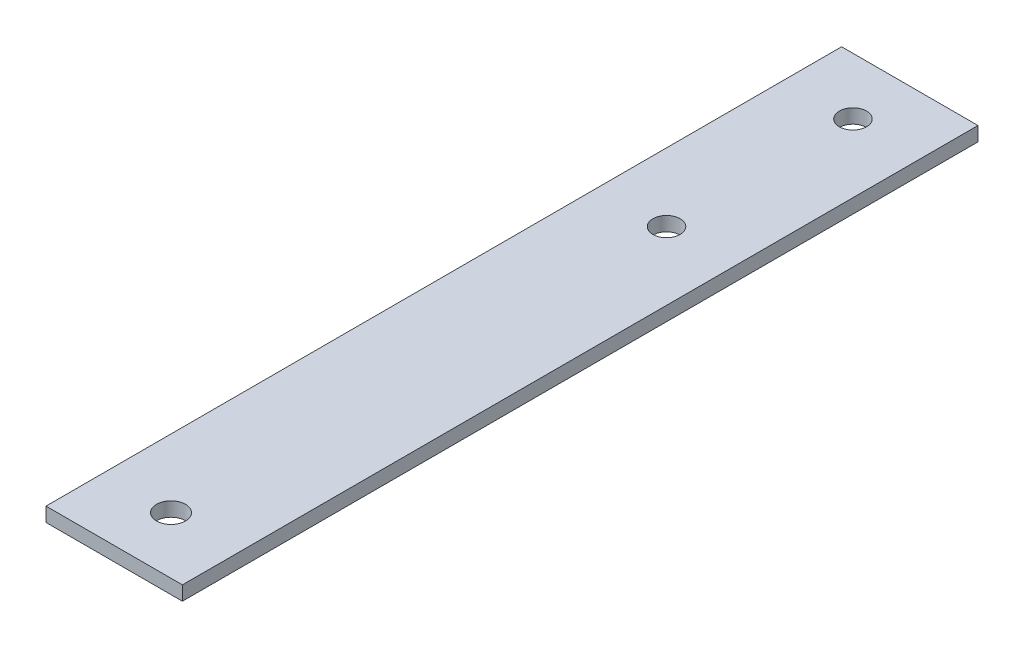
ISO-10303-21;
HEADER;
FILE_DESCRIPTION(('STEP AP214'),'2;1');
FILE_NAME('part.step','',(''),(''),'','','');
FILE_SCHEMA(('AUTOMOTIVE_DESIGN { 1 0 10303 214 1 1 1 1 }'));
ENDSEC;
DATA;
#1=APPLICATION_CONTEXT('core data for automotive mechanical design processes');
#2=APPLICATION_PROTOCOL_DEFINITION('international standard','automotive_design',2000,#1);
#3=PRODUCT_CONTEXT('',#1,'mechanical');
#4=PRODUCT('Part','Part','',(#3));
#5=PRODUCT_RELATED_PRODUCT_CATEGORY('part','',(#4));
#6=PRODUCT_DEFINITION_FORMATION('','',#4);
#7=PRODUCT_DEFINITION_CONTEXT('part definition',#1,'design');
#8=PRODUCT_DEFINITION('design','',#6,#7);
#9=PRODUCT_DEFINITION_SHAPE('','',#8);
#10=(LENGTH_UNIT() NAMED_UNIT(*) SI_UNIT(.MILLI.,.METRE.));
#11=(NAMED_UNIT(*) PLANE_ANGLE_UNIT() SI_UNIT($,.RADIAN.));
#12=(NAMED_UNIT(*) SI_UNIT($,.STERADIAN.) SOLID_ANGLE_UNIT());
#13=UNCERTAINTY_MEASURE_WITH_UNIT(LENGTH_MEASURE(1.E-05),#10,'distance_accuracy_value','');
#14=(GEOMETRIC_REPRESENTATION_CONTEXT(3) GLOBAL_UNCERTAINTY_ASSIGNED_CONTEXT((#13)) GLOBAL_UNIT_ASSIGNED_CONTEXT((#10,
#11,#12)) REPRESENTATION_CONTEXT('',''));
#15=CARTESIAN_POINT('',(0.,0.,0.));
#16=DIRECTION('',(0.,0.,1.));
#17=DIRECTION('',(1.,0.,0.));
#18=AXIS2_PLACEMENT_3D('',#15,#16,#17);
#19=CARTESIAN_POINT('',(-20.723933876653,3.175,88.9));
#20=DIRECTION('',(0.,-1.,0.));
#21=DIRECTION('',(0.,0.,-1.));
#22=AXIS2_PLACEMENT_3D('',#19,#20,#21);
#23=PLANE('',#22);
#24=CARTESIAN_POINT('',(-35.963933876653,3.175,-34.529268));
#25=DIRECTION('',(0.,1.,0.));
#26=DIRECTION('',(0.,0.,1.));
#27=AXIS2_PLACEMENT_3D('',#24,#25,#26);
#28=CIRCLE('',#27,3.048);
#29=CARTESIAN_POINT('',(-35.963933876653,3.175,-31.481268));
#30=VERTEX_POINT('',#29);
#31=EDGE_CURVE('E114',#30,#30,#28,.T.);
#32=ORIENTED_EDGE('',*,*,#31,.F.);
#33=EDGE_LOOP('',(#32));
#34=FACE_BOUND('',#33,.T.);
#35=DIRECTION('',(1.,0.,0.));
#36=VECTOR('',#35,1.);
#37=CARTESIAN_POINT('',(-51.2039338766529,3.175,88.9));
#38=LINE('',#37,#36);
#39=CARTESIAN_POINT('',(-51.2039338766529,3.175,88.9));
#40=VERTEX_POINT('',#39);
#41=CARTESIAN_POINT('',(-20.723933876653,3.175,88.9));
#42=VERTEX_POINT('',#41);
#43=EDGE_CURVE('E84',#40,#42,#38,.T.);
#44=ORIENTED_EDGE('',*,*,#43,.T.);
#45=DIRECTION('',(0.,0.,-1.));
#46=VECTOR('',#45,1.);
#47=CARTESIAN_POINT('',(-20.723933876653,3.175,-88.9));
#48=LINE('',#47,#46);
#49=CARTESIAN_POINT('',(-20.723933876653,3.175,-88.9));
#50=VERTEX_POINT('',#49);
#51=EDGE_CURVE('E79',#42,#50,#48,.T.);
#52=ORIENTED_EDGE('',*,*,#51,.T.);
#53=DIRECTION('',(-1.,0.,0.));
#54=VECTOR('',#53,1.);
#55=CARTESIAN_POINT('',(-51.2039338766529,3.175,-88.9));
#56=LINE('',#55,#54);
#57=CARTESIAN_POINT('',(-51.2039338766529,3.175,-88.9));
#58=VERTEX_POINT('',#57);
#59=EDGE_CURVE('E82',#50,#58,#56,.T.);
#60=ORIENTED_EDGE('',*,*,#59,.T.);
#61=DIRECTION('',(0.,0.,1.));
#62=VECTOR('',#61,1.);
#63=CARTESIAN_POINT('',(-51.2039338766529,3.175,-88.9));
#64=LINE('',#63,#62);
#65=EDGE_CURVE('E49',#58,#40,#64,.T.);
#66=ORIENTED_EDGE('',*,*,#65,.T.);
#67=EDGE_LOOP('',(#44,#52,#60,#66));
#68=FACE_BOUND('',#67,.T.);
#69=CARTESIAN_POINT('',(-35.963933876653,3.175,-76.2));
#70=DIRECTION('',(0.,1.,0.));
#71=DIRECTION('',(0.,0.,1.));
#72=AXIS2_PLACEMENT_3D('',#69,#70,#71);
#73=CIRCLE('',#72,3.048);
#74=CARTESIAN_POINT('',(-35.963933876653,3.175,-73.152));
#75=VERTEX_POINT('',#74);
#76=EDGE_CURVE('E99',#75,#75,#73,.T.);
#77=ORIENTED_EDGE('',*,*,#76,.F.);
#78=EDGE_LOOP('',(#77));
#79=FACE_BOUND('',#78,.T.);
#80=CARTESIAN_POINT('',(-35.9639338766529,3.175,76.2));
#81=DIRECTION('',(0.,1.,0.));
#82=DIRECTION('',(0.,0.,1.));
#83=AXIS2_PLACEMENT_3D('',#80,#81,#82);
#84=CIRCLE('',#83,3.2385);
#85=CARTESIAN_POINT('',(-35.9639338766529,3.175,79.4385));
#86=VERTEX_POINT('',#85);
#87=EDGE_CURVE('E120',#86,#86,#84,.T.);
#88=ORIENTED_EDGE('',*,*,#87,.F.);
#89=EDGE_LOOP('',(#88));
#90=FACE_BOUND('',#89,.T.);
#91=ADVANCED_FACE('F32',(#34,#68,#79,#90),#23,.F.);
#92=CARTESIAN_POINT('',(-20.723933876653,0.,88.9));
#93=DIRECTION('',(0.,-1.,0.));
#94=DIRECTION('',(0.,0.,-1.));
#95=AXIS2_PLACEMENT_3D('',#92,#93,#94);
#96=PLANE('',#95);
#97=CARTESIAN_POINT('',(-35.963933876653,0.,-34.529268));
#98=DIRECTION('',(0.,1.,0.));
#99=DIRECTION('',(0.,0.,1.));
#100=AXIS2_PLACEMENT_3D('',#97,#98,#99);
#101=CIRCLE('',#100,3.048);
#102=CARTESIAN_POINT('',(-35.963933876653,0.,-31.481268));
#103=VERTEX_POINT('',#102);
#104=EDGE_CURVE('E117',#103,#103,#101,.T.);
#105=ORIENTED_EDGE('',*,*,#104,.T.);
#106=EDGE_LOOP('',(#105));
#107=FACE_BOUND('',#106,.T.);
#108=DIRECTION('',(1.,0.,0.));
#109=VECTOR('',#108,1.);
#110=CARTESIAN_POINT('',(-51.2039338766529,0.,88.9));
#111=LINE('',#110,#109);
#112=CARTESIAN_POINT('',(-51.2039338766529,0.,88.9));
#113=VERTEX_POINT('',#112);
#114=CARTESIAN_POINT('',(-20.723933876653,0.,88.9));
#115=VERTEX_POINT('',#114);
#116=EDGE_CURVE('E96',#113,#115,#111,.T.);
#117=ORIENTED_EDGE('',*,*,#116,.F.);
#118=DIRECTION('',(0.,0.,1.));
#119=VECTOR('',#118,1.);
#120=CARTESIAN_POINT('',(-51.2039338766529,0.,-88.9));
#121=LINE('',#120,#119);
#122=CARTESIAN_POINT('',(-51.2039338766529,0.,-88.9));
#123=VERTEX_POINT('',#122);
#124=EDGE_CURVE('E72',#123,#113,#121,.T.);
#125=ORIENTED_EDGE('',*,*,#124,.F.);
#126=DIRECTION('',(-1.,0.,0.));
#127=VECTOR('',#126,1.);
#128=CARTESIAN_POINT('',(-51.2039338766529,0.,-88.9));
#129=LINE('',#128,#127);
#130=CARTESIAN_POINT('',(-20.723933876653,0.,-88.9));
#131=VERTEX_POINT('',#130);
#132=EDGE_CURVE('E66',#131,#123,#129,.T.);
#133=ORIENTED_EDGE('',*,*,#132,.F.);
#134=DIRECTION('',(0.,0.,-1.));
#135=VECTOR('',#134,1.);
#136=CARTESIAN_POINT('',(-20.723933876653,0.,-88.9));
#137=LINE('',#136,#135);
#138=EDGE_CURVE('E88',#115,#131,#137,.T.);
#139=ORIENTED_EDGE('',*,*,#138,.F.);
#140=EDGE_LOOP('',(#117,#125,#133,#139));
#141=FACE_BOUND('',#140,.T.);
#142=CARTESIAN_POINT('',(-35.963933876653,0.,-76.2));
#143=DIRECTION('',(0.,1.,0.));
#144=DIRECTION('',(0.,0.,1.));
#145=AXIS2_PLACEMENT_3D('',#142,#143,#144);
#146=CIRCLE('',#145,3.048);
#147=CARTESIAN_POINT('',(-35.963933876653,0.,-73.152));
#148=VERTEX_POINT('',#147);
#149=EDGE_CURVE('E111',#148,#148,#146,.T.);
#150=ORIENTED_EDGE('',*,*,#149,.T.);
#151=EDGE_LOOP('',(#150));
#152=FACE_BOUND('',#151,.T.);
#153=CARTESIAN_POINT('',(-35.9639338766529,0.,76.2));
#154=DIRECTION('',(0.,1.,0.));
#155=DIRECTION('',(0.,0.,1.));
#156=AXIS2_PLACEMENT_3D('',#153,#154,#155);
#157=CIRCLE('',#156,3.2385);
#158=CARTESIAN_POINT('',(-35.9639338766529,0.,79.4385));
#159=VERTEX_POINT('',#158);
#160=EDGE_CURVE('E123',#159,#159,#157,.T.);
#161=ORIENTED_EDGE('',*,*,#160,.T.);
#162=EDGE_LOOP('',(#161));
#163=FACE_BOUND('',#162,.T.);
#164=ADVANCED_FACE('F107',(#107,#141,#152,#163),#96,.T.);
#165=CARTESIAN_POINT('',(-51.2039338766529,3.175,88.9));
#166=DIRECTION('',(0.,0.,-1.));
#167=DIRECTION('',(-1.,0.,0.));
#168=AXIS2_PLACEMENT_3D('',#165,#166,#167);
#169=PLANE('',#168);
#170=ORIENTED_EDGE('',*,*,#116,.T.);
#171=DIRECTION('',(0.,-1.,0.));
#172=VECTOR('',#171,1.);
#173=CARTESIAN_POINT('',(-20.723933876653,3.175,88.9));
#174=LINE('',#173,#172);
#175=EDGE_CURVE('E11',#42,#115,#174,.T.);
#176=ORIENTED_EDGE('',*,*,#175,.F.);
#177=ORIENTED_EDGE('',*,*,#43,.F.);
#178=DIRECTION('',(0.,-1.,0.));
#179=VECTOR('',#178,1.);
#180=CARTESIAN_POINT('',(-51.2039338766529,3.175,88.9));
#181=LINE('',#180,#179);
#182=EDGE_CURVE('E92',#40,#113,#181,.T.);
#183=ORIENTED_EDGE('',*,*,#182,.T.);
#184=EDGE_LOOP('',(#170,#176,#177,#183));
#185=FACE_BOUND('',#184,.T.);
#186=ADVANCED_FACE('F34',(#185),#169,.F.);
#187=CARTESIAN_POINT('',(-20.723933876653,3.175,-88.9));
#188=DIRECTION('',(-1.,0.,0.));
#189=DIRECTION('',(0.,0.,1.));
#190=AXIS2_PLACEMENT_3D('',#187,#188,#189);
#191=PLANE('',#190);
#192=ORIENTED_EDGE('',*,*,#138,.T.);
#193=DIRECTION('',(0.,-1.,0.));
#194=VECTOR('',#193,1.);
#195=CARTESIAN_POINT('',(-20.723933876653,3.175,-88.9));
#196=LINE('',#195,#194);
#197=EDGE_CURVE('E41',#50,#131,#196,.T.);
#198=ORIENTED_EDGE('',*,*,#197,.F.);
#199=ORIENTED_EDGE('',*,*,#51,.F.);
#200=ORIENTED_EDGE('',*,*,#175,.T.);
#201=EDGE_LOOP('',(#192,#198,#199,#200));
#202=FACE_BOUND('',#201,.T.);
#203=ADVANCED_FACE('F87',(#202),#191,.F.);
#204=CARTESIAN_POINT('',(-51.2039338766529,3.175,-88.9));
#205=DIRECTION('',(0.,0.,1.));
#206=DIRECTION('',(1.,0.,0.));
#207=AXIS2_PLACEMENT_3D('',#204,#205,#206);
#208=PLANE('',#207);
#209=ORIENTED_EDGE('',*,*,#132,.T.);
#210=DIRECTION('',(0.,-1.,0.));
#211=VECTOR('',#210,1.);
#212=CARTESIAN_POINT('',(-51.2039338766529,3.175,-88.9));
#213=LINE('',#212,#211);
#214=EDGE_CURVE('E89',#58,#123,#213,.T.);
#215=ORIENTED_EDGE('',*,*,#214,.F.);
#216=ORIENTED_EDGE('',*,*,#59,.F.);
#217=ORIENTED_EDGE('',*,*,#197,.T.);
#218=EDGE_LOOP('',(#209,#215,#216,#217));
#219=FACE_BOUND('',#218,.T.);
#220=ADVANCED_FACE('F90',(#219),#208,.F.);
#221=CARTESIAN_POINT('',(-51.2039338766529,3.175,-88.9));
#222=DIRECTION('',(1.,0.,0.));
#223=DIRECTION('',(0.,0.,-1.));
#224=AXIS2_PLACEMENT_3D('',#221,#222,#223);
#225=PLANE('',#224);
#226=ORIENTED_EDGE('',*,*,#124,.T.);
#227=ORIENTED_EDGE('',*,*,#182,.F.);
#228=ORIENTED_EDGE('',*,*,#65,.F.);
#229=ORIENTED_EDGE('',*,*,#214,.T.);
#230=EDGE_LOOP('',(#226,#227,#228,#229));
#231=FACE_BOUND('',#230,.T.);
#232=ADVANCED_FACE('F104',(#231),#225,.F.);
#233=CARTESIAN_POINT('',(-35.963933876653,3.175,-76.2));
#234=DIRECTION('',(0.,-1.,0.));
#235=DIRECTION('',(0.,0.,-1.));
#236=AXIS2_PLACEMENT_3D('',#233,#234,#235);
#237=CYLINDRICAL_SURFACE('',#236,3.048);
#238=ORIENTED_EDGE('',*,*,#76,.T.);
#239=EDGE_LOOP('',(#238));
#240=FACE_BOUND('',#239,.T.);
#241=ORIENTED_EDGE('',*,*,#149,.F.);
#242=EDGE_LOOP('',(#241));
#243=FACE_BOUND('',#242,.T.);
#244=ADVANCED_FACE('F142',(#240,#243),#237,.F.);
#245=CARTESIAN_POINT('',(-35.963933876653,3.175,-34.529268));
#246=DIRECTION('',(0.,-1.,0.));
#247=DIRECTION('',(0.,0.,-1.));
#248=AXIS2_PLACEMENT_3D('',#245,#246,#247);
#249=CYLINDRICAL_SURFACE('',#248,3.048);
#250=ORIENTED_EDGE('',*,*,#31,.T.);
#251=EDGE_LOOP('',(#250));
#252=FACE_BOUND('',#251,.T.);
#253=ORIENTED_EDGE('',*,*,#104,.F.);
#254=EDGE_LOOP('',(#253));
#255=FACE_BOUND('',#254,.T.);
#256=ADVANCED_FACE('F188',(#252,#255),#249,.F.);
#257=CARTESIAN_POINT('',(-35.9639338766529,3.175,76.2));
#258=DIRECTION('',(0.,-1.,0.));
#259=DIRECTION('',(0.,0.,-1.));
#260=AXIS2_PLACEMENT_3D('',#257,#258,#259);
#261=CYLINDRICAL_SURFACE('',#260,3.2385);
#262=ORIENTED_EDGE('',*,*,#87,.T.);
#263=EDGE_LOOP('',(#262));
#264=FACE_BOUND('',#263,.T.);
#265=ORIENTED_EDGE('',*,*,#160,.F.);
#266=EDGE_LOOP('',(#265));
#267=FACE_BOUND('',#266,.T.);
#268=ADVANCED_FACE('F129',(#264,#267),#261,.F.);
#269=CLOSED_SHELL('',(#91,#164,#186,#203,#220,#232,#244,#256,#268));
#270=MANIFOLD_SOLID_BREP('B2',#269);
#271=ADVANCED_BREP_SHAPE_REPRESENTATION('',(#18,#270),#14);
#272=SHAPE_DEFINITION_REPRESENTATION(#9,#271);
ENDSEC;
END-ISO-10303-21;
